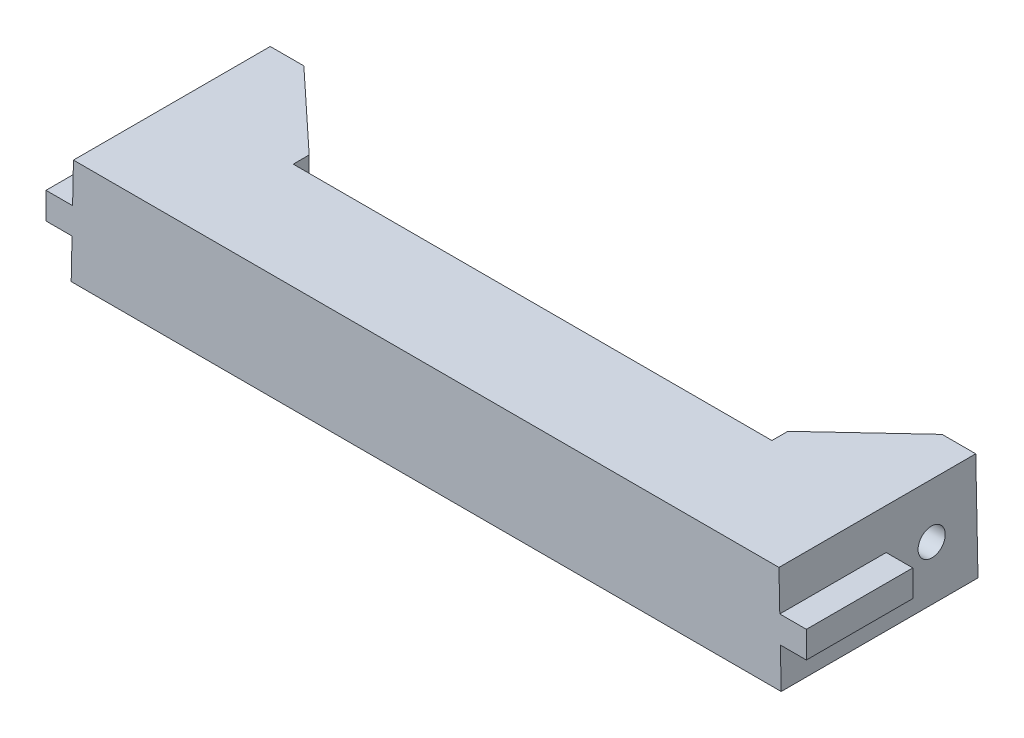
ISO-10303-21;
HEADER;
FILE_DESCRIPTION(('STEP AP214'),'2;1');
FILE_NAME('part.step','',(''),(''),'','','');
FILE_SCHEMA(('AUTOMOTIVE_DESIGN { 1 0 10303 214 1 1 1 1 }'));
ENDSEC;
DATA;
#1=APPLICATION_CONTEXT('core data for automotive mechanical design processes');
#2=APPLICATION_PROTOCOL_DEFINITION('international standard','automotive_design',2000,#1);
#3=PRODUCT_CONTEXT('',#1,'mechanical');
#4=PRODUCT('Part','Part','',(#3));
#5=PRODUCT_RELATED_PRODUCT_CATEGORY('part','',(#4));
#6=PRODUCT_DEFINITION_FORMATION('','',#4);
#7=PRODUCT_DEFINITION_CONTEXT('part definition',#1,'design');
#8=PRODUCT_DEFINITION('design','',#6,#7);
#9=PRODUCT_DEFINITION_SHAPE('','',#8);
#10=(LENGTH_UNIT() NAMED_UNIT(*) SI_UNIT(.MILLI.,.METRE.));
#11=(NAMED_UNIT(*) PLANE_ANGLE_UNIT() SI_UNIT($,.RADIAN.));
#12=(NAMED_UNIT(*) SI_UNIT($,.STERADIAN.) SOLID_ANGLE_UNIT());
#13=UNCERTAINTY_MEASURE_WITH_UNIT(LENGTH_MEASURE(1.E-05),#10,'distance_accuracy_value','');
#14=(GEOMETRIC_REPRESENTATION_CONTEXT(3) GLOBAL_UNCERTAINTY_ASSIGNED_CONTEXT((#13)) GLOBAL_UNIT_ASSIGNED_CONTEXT((#10,
#11,#12)) REPRESENTATION_CONTEXT('',''));
#15=CARTESIAN_POINT('',(0.,0.,0.));
#16=DIRECTION('',(0.,0.,1.));
#17=DIRECTION('',(1.,0.,0.));
#18=AXIS2_PLACEMENT_3D('',#15,#16,#17);
#19=CARTESIAN_POINT('',(0.,0.,0.));
#20=DIRECTION('',(0.,0.,1.));
#21=DIRECTION('',(1.,0.,0.));
#22=AXIS2_PLACEMENT_3D('',#19,#20,#21);
#23=PLANE('',#22);
#24=DIRECTION('',(0.,-1.,0.));
#25=VECTOR('',#24,1.);
#26=CARTESIAN_POINT('',(-45.,0.,0.));
#27=LINE('',#26,#25);
#28=CARTESIAN_POINT('',(-45.,20.,0.));
#29=VERTEX_POINT('',#28);
#30=CARTESIAN_POINT('',(-45.,0.,0.));
#31=VERTEX_POINT('',#30);
#32=EDGE_CURVE('E151',#29,#31,#27,.T.);
#33=ORIENTED_EDGE('',*,*,#32,.F.);
#34=DIRECTION('',(-1.,0.,0.));
#35=VECTOR('',#34,1.);
#36=CARTESIAN_POINT('',(-66.3208214077717,20.,0.));
#37=LINE('',#36,#35);
#38=CARTESIAN_POINT('',(45.,20.,0.));
#39=VERTEX_POINT('',#38);
#40=EDGE_CURVE('E764',#39,#29,#37,.T.);
#41=ORIENTED_EDGE('',*,*,#40,.F.);
#42=DIRECTION('',(0.,-1.,0.));
#43=VECTOR('',#42,1.);
#44=CARTESIAN_POINT('',(45.,20.,0.));
#45=LINE('',#44,#43);
#46=CARTESIAN_POINT('',(45.,0.,0.));
#47=VERTEX_POINT('',#46);
#48=EDGE_CURVE('E793',#39,#47,#45,.T.);
#49=ORIENTED_EDGE('',*,*,#48,.T.);
#50=DIRECTION('',(1.,0.,0.));
#51=VECTOR('',#50,1.);
#52=CARTESIAN_POINT('',(-66.745,0.,0.));
#53=LINE('',#52,#51);
#54=EDGE_CURVE('E792',#31,#47,#53,.T.);
#55=ORIENTED_EDGE('',*,*,#54,.F.);
#56=EDGE_LOOP('',(#33,#41,#49,#55));
#57=FACE_BOUND('',#56,.T.);
#58=ADVANCED_FACE('F126',(#57),#23,.F.);
#59=CARTESIAN_POINT('',(-66.745,0.,20.));
#60=DIRECTION('',(0.99977516650026,-0.021204161133545,0.));
#61=DIRECTION('',(0.021204161133545,0.99977516650026,0.));
#62=AXIS2_PLACEMENT_3D('',#59,#60,#61);
#63=PLANE('',#62);
#64=CARTESIAN_POINT('',(-66.5329107038858,10.,-8.5));
#65=DIRECTION('',(0.99977516650026,-0.021204161133545,0.));
#66=DIRECTION('',(0.021204161133545,0.99977516650026,0.));
#67=AXIS2_PLACEMENT_3D('',#64,#65,#66);
#68=ELLIPSE('',#67,2.55057345435609,2.55);
#69=CARTESIAN_POINT('',(-66.4788279333767,12.55,-8.5));
#70=VERTEX_POINT('',#69);
#71=EDGE_CURVE('E361',#70,#70,#68,.F.);
#72=ORIENTED_EDGE('',*,*,#71,.F.);
#73=EDGE_LOOP('',(#72));
#74=FACE_BOUND('',#73,.T.);
#75=DIRECTION('',(0.,0.,1.));
#76=VECTOR('',#75,1.);
#77=CARTESIAN_POINT('',(-66.4798883798573,12.5,-7.07106781186548));
#78=LINE('',#77,#76);
#79=CARTESIAN_POINT('',(-66.4798883798573,12.5,0.));
#80=VERTEX_POINT('',#79);
#81=CARTESIAN_POINT('',(-66.4798883798573,12.4999999999998,20.));
#82=VERTEX_POINT('',#81);
#83=EDGE_CURVE('E511',#80,#82,#78,.T.);
#84=ORIENTED_EDGE('',*,*,#83,.T.);
#85=DIRECTION('',(-0.021204161133545,-0.99977516650026,0.));
#86=VECTOR('',#85,1.);
#87=CARTESIAN_POINT('',(-66.745,0.,20.));
#88=LINE('',#87,#86);
#89=CARTESIAN_POINT('',(-66.3208214077717,20.,20.));
#90=VERTEX_POINT('',#89);
#91=EDGE_CURVE('E732',#90,#82,#88,.T.);
#92=ORIENTED_EDGE('',*,*,#91,.F.);
#93=DIRECTION('',(0.,0.,-1.));
#94=VECTOR('',#93,1.);
#95=CARTESIAN_POINT('',(-66.3208214077717,20.,20.));
#96=LINE('',#95,#94);
#97=CARTESIAN_POINT('',(-66.3208214077717,20.,0.));
#98=VERTEX_POINT('',#97);
#99=EDGE_CURVE('E701',#90,#98,#96,.T.);
#100=ORIENTED_EDGE('',*,*,#99,.T.);
#101=CARTESIAN_POINT('',(-66.3208214077717,20.,0.));
#102=DIRECTION('',(0.,0.,-1.));
#103=VECTOR('',#102,1.);
#104=LINE('',#101,#103);
#105=CARTESIAN_POINT('',(-66.3208214077717,20.,-17.));
#106=VERTEX_POINT('',#105);
#107=EDGE_CURVE('E412',#98,#106,#104,.T.);
#108=ORIENTED_EDGE('',*,*,#107,.T.);
#109=CARTESIAN_POINT('',(-66.3208214077717,20.,-17.));
#110=DIRECTION('',(-0.021204161133545,-0.99977516650026,0.));
#111=VECTOR('',#110,1.);
#112=LINE('',#109,#111);
#113=CARTESIAN_POINT('',(-66.745,0.,-17.));
#114=VERTEX_POINT('',#113);
#115=EDGE_CURVE('E718',#106,#114,#112,.T.);
#116=ORIENTED_EDGE('',*,*,#115,.T.);
#117=CARTESIAN_POINT('',(-66.745,0.,0.));
#118=DIRECTION('',(0.,0.,-1.));
#119=VECTOR('',#118,1.);
#120=LINE('',#117,#119);
#121=CARTESIAN_POINT('',(-66.745,0.,0.));
#122=VERTEX_POINT('',#121);
#123=EDGE_CURVE('E711',#122,#114,#120,.T.);
#124=ORIENTED_EDGE('',*,*,#123,.F.);
#125=DIRECTION('',(0.,0.,-1.));
#126=VECTOR('',#125,1.);
#127=CARTESIAN_POINT('',(-66.745,0.,20.));
#128=LINE('',#127,#126);
#129=CARTESIAN_POINT('',(-66.745,0.,20.));
#130=VERTEX_POINT('',#129);
#131=EDGE_CURVE('E697',#130,#122,#128,.T.);
#132=ORIENTED_EDGE('',*,*,#131,.F.);
#133=CARTESIAN_POINT('',(-66.5859330279144,7.5,20.));
#134=VERTEX_POINT('',#133);
#135=EDGE_CURVE('E739',#134,#130,#88,.T.);
#136=ORIENTED_EDGE('',*,*,#135,.F.);
#137=DIRECTION('',(0.,0.,1.));
#138=VECTOR('',#137,1.);
#139=CARTESIAN_POINT('',(-66.5859330279144,7.5,20.));
#140=LINE('',#139,#138);
#141=CARTESIAN_POINT('',(-66.5859330279144,7.5,0.));
#142=VERTEX_POINT('',#141);
#143=EDGE_CURVE('E531',#142,#134,#140,.T.);
#144=ORIENTED_EDGE('',*,*,#143,.F.);
#145=DIRECTION('',(-0.0212041611335429,-0.99977516650026,0.));
#146=VECTOR('',#145,1.);
#147=CARTESIAN_POINT('',(-66.4798883798573,12.5,0.));
#148=LINE('',#147,#146);
#149=EDGE_CURVE('E374',#80,#142,#148,.T.);
#150=ORIENTED_EDGE('',*,*,#149,.F.);
#151=EDGE_LOOP('',(#84,#92,#100,#108,#116,#124,#132,#136,#144,#150));
#152=FACE_BOUND('',#151,.T.);
#153=ADVANCED_FACE('F605',(#74,#152),#63,.F.);
#154=CARTESIAN_POINT('',(66.3208214077717,20.,20.));
#155=DIRECTION('',(-0.99977516650026,-0.021204161133545,0.));
#156=DIRECTION('',(0.021204161133545,-0.99977516650026,0.));
#157=AXIS2_PLACEMENT_3D('',#154,#155,#156);
#158=PLANE('',#157);
#159=CARTESIAN_POINT('',(66.5329107038858,10.,-8.5));
#160=DIRECTION('',(-0.99977516650026,-0.021204161133545,0.));
#161=DIRECTION('',(-0.021204161133545,0.99977516650026,0.));
#162=AXIS2_PLACEMENT_3D('',#159,#160,#161);
#163=ELLIPSE('',#162,2.55057345435609,2.55);
#164=CARTESIAN_POINT('',(66.4788279333767,12.55,-8.5));
#165=VERTEX_POINT('',#164);
#166=EDGE_CURVE('E490',#165,#165,#163,.T.);
#167=ORIENTED_EDGE('',*,*,#166,.T.);
#168=EDGE_LOOP('',(#167));
#169=FACE_BOUND('',#168,.T.);
#170=DIRECTION('',(-0.021204161133545,0.99977516650026,0.));
#171=VECTOR('',#170,1.);
#172=CARTESIAN_POINT('',(66.3208214077717,20.,20.));
#173=LINE('',#172,#171);
#174=CARTESIAN_POINT('',(66.4798883798573,12.5,20.));
#175=VERTEX_POINT('',#174);
#176=CARTESIAN_POINT('',(66.3208214077717,20.,20.));
#177=VERTEX_POINT('',#176);
#178=EDGE_CURVE('E741',#175,#177,#173,.T.);
#179=ORIENTED_EDGE('',*,*,#178,.F.);
#180=DIRECTION('',(0.,0.,1.));
#181=VECTOR('',#180,1.);
#182=CARTESIAN_POINT('',(66.4798883798573,12.5,-7.07106781186548));
#183=LINE('',#182,#181);
#184=CARTESIAN_POINT('',(66.4798883798573,12.5,0.));
#185=VERTEX_POINT('',#184);
#186=EDGE_CURVE('E523',#185,#175,#183,.T.);
#187=ORIENTED_EDGE('',*,*,#186,.F.);
#188=DIRECTION('',(-0.021204161133545,0.99977516650026,0.));
#189=VECTOR('',#188,1.);
#190=CARTESIAN_POINT('',(66.3208214077717,20.,0.));
#191=LINE('',#190,#189);
#192=CARTESIAN_POINT('',(66.5859330279144,7.5,0.));
#193=VERTEX_POINT('',#192);
#194=EDGE_CURVE('E675',#193,#185,#191,.T.);
#195=ORIENTED_EDGE('',*,*,#194,.F.);
#196=DIRECTION('',(0.,0.,1.));
#197=VECTOR('',#196,1.);
#198=CARTESIAN_POINT('',(66.5859330279144,7.5,20.));
#199=LINE('',#198,#197);
#200=CARTESIAN_POINT('',(66.5859330279144,7.5,20.));
#201=VERTEX_POINT('',#200);
#202=EDGE_CURVE('E552',#193,#201,#199,.T.);
#203=ORIENTED_EDGE('',*,*,#202,.T.);
#204=CARTESIAN_POINT('',(66.745,0.,20.));
#205=VERTEX_POINT('',#204);
#206=EDGE_CURVE('E577',#205,#201,#173,.T.);
#207=ORIENTED_EDGE('',*,*,#206,.F.);
#208=DIRECTION('',(0.,0.,-1.));
#209=VECTOR('',#208,1.);
#210=CARTESIAN_POINT('',(66.745,0.,20.));
#211=LINE('',#210,#209);
#212=CARTESIAN_POINT('',(66.745,0.,0.));
#213=VERTEX_POINT('',#212);
#214=EDGE_CURVE('E702',#205,#213,#211,.T.);
#215=ORIENTED_EDGE('',*,*,#214,.T.);
#216=DIRECTION('',(0.,0.,-1.));
#217=VECTOR('',#216,1.);
#218=CARTESIAN_POINT('',(66.745,0.,0.));
#219=LINE('',#218,#217);
#220=CARTESIAN_POINT('',(66.745,0.,-17.));
#221=VERTEX_POINT('',#220);
#222=EDGE_CURVE('E565',#213,#221,#219,.T.);
#223=ORIENTED_EDGE('',*,*,#222,.T.);
#224=DIRECTION('',(0.021204161133545,-0.99977516650026,0.));
#225=VECTOR('',#224,1.);
#226=CARTESIAN_POINT('',(66.3208214077717,20.,-17.));
#227=LINE('',#226,#225);
#228=CARTESIAN_POINT('',(66.3208214077717,20.,-17.));
#229=VERTEX_POINT('',#228);
#230=EDGE_CURVE('E572',#229,#221,#227,.T.);
#231=ORIENTED_EDGE('',*,*,#230,.F.);
#232=DIRECTION('',(0.,0.,-1.));
#233=VECTOR('',#232,1.);
#234=CARTESIAN_POINT('',(66.3208214077717,20.,0.));
#235=LINE('',#234,#233);
#236=CARTESIAN_POINT('',(66.3208214077717,20.,0.));
#237=VERTEX_POINT('',#236);
#238=EDGE_CURVE('E742',#237,#229,#235,.T.);
#239=ORIENTED_EDGE('',*,*,#238,.F.);
#240=DIRECTION('',(0.,0.,-1.));
#241=VECTOR('',#240,1.);
#242=CARTESIAN_POINT('',(66.3208214077717,20.,20.));
#243=LINE('',#242,#241);
#244=EDGE_CURVE('E707',#177,#237,#243,.T.);
#245=ORIENTED_EDGE('',*,*,#244,.F.);
#246=EDGE_LOOP('',(#179,#187,#195,#203,#207,#215,#223,#231,#239,#245));
#247=FACE_BOUND('',#246,.T.);
#248=ADVANCED_FACE('F128',(#169,#247),#158,.F.);
#249=CARTESIAN_POINT('',(-66.3208214077717,20.,20.));
#250=DIRECTION('',(0.,-1.,0.));
#251=DIRECTION('',(0.,0.,-1.));
#252=AXIS2_PLACEMENT_3D('',#249,#250,#251);
#253=PLANE('',#252);
#254=ORIENTED_EDGE('',*,*,#40,.T.);
#255=CARTESIAN_POINT('',(-45.,20.,-3.));
#256=DIRECTION('',(0.,0.,1.));
#257=VECTOR('',#256,1.);
#258=LINE('',#255,#257);
#259=CARTESIAN_POINT('',(-45.,20.,-3.));
#260=VERTEX_POINT('',#259);
#261=EDGE_CURVE('E338',#260,#29,#258,.T.);
#262=ORIENTED_EDGE('',*,*,#261,.F.);
#263=DIRECTION('',(0.731055268242869,0.,0.682318250360011));
#264=VECTOR('',#263,1.);
#265=CARTESIAN_POINT('',(-60.,20.,-17.));
#266=LINE('',#265,#264);
#267=CARTESIAN_POINT('',(-60.,20.,-17.));
#268=VERTEX_POINT('',#267);
#269=EDGE_CURVE('E298',#268,#260,#266,.T.);
#270=ORIENTED_EDGE('',*,*,#269,.F.);
#271=DIRECTION('',(-1.,0.,0.));
#272=VECTOR('',#271,1.);
#273=CARTESIAN_POINT('',(-60.,20.,-17.));
#274=LINE('',#273,#272);
#275=EDGE_CURVE('E366',#268,#106,#274,.T.);
#276=ORIENTED_EDGE('',*,*,#275,.T.);
#277=ORIENTED_EDGE('',*,*,#107,.F.);
#278=ORIENTED_EDGE('',*,*,#99,.F.);
#279=DIRECTION('',(-1.,0.,0.));
#280=VECTOR('',#279,1.);
#281=CARTESIAN_POINT('',(-66.3208214077717,20.,20.));
#282=LINE('',#281,#280);
#283=EDGE_CURVE('E735',#177,#90,#282,.T.);
#284=ORIENTED_EDGE('',*,*,#283,.F.);
#285=ORIENTED_EDGE('',*,*,#244,.T.);
#286=ORIENTED_EDGE('',*,*,#238,.T.);
#287=DIRECTION('',(1.,0.,0.));
#288=VECTOR('',#287,1.);
#289=CARTESIAN_POINT('',(60.,20.,-17.));
#290=LINE('',#289,#288);
#291=CARTESIAN_POINT('',(60.,20.,-17.));
#292=VERTEX_POINT('',#291);
#293=EDGE_CURVE('E556',#292,#229,#290,.T.);
#294=ORIENTED_EDGE('',*,*,#293,.F.);
#295=DIRECTION('',(-0.731055268242869,0.,0.682318250360011));
#296=VECTOR('',#295,1.);
#297=CARTESIAN_POINT('',(60.,20.,-17.));
#298=LINE('',#297,#296);
#299=CARTESIAN_POINT('',(45.,20.,-3.));
#300=VERTEX_POINT('',#299);
#301=EDGE_CURVE('E419',#292,#300,#298,.T.);
#302=ORIENTED_EDGE('',*,*,#301,.T.);
#303=DIRECTION('',(0.,0.,1.));
#304=VECTOR('',#303,1.);
#305=CARTESIAN_POINT('',(45.,20.,-3.));
#306=LINE('',#305,#304);
#307=EDGE_CURVE('E423',#300,#39,#306,.T.);
#308=ORIENTED_EDGE('',*,*,#307,.T.);
#309=EDGE_LOOP('',(#254,#262,#270,#276,#277,#278,#284,#285,#286,#294,#302,#308));
#310=FACE_BOUND('',#309,.T.);
#311=ADVANCED_FACE('F604',(#310),#253,.F.);
#312=CARTESIAN_POINT('',(-66.745,0.,20.));
#313=DIRECTION('',(0.,1.,0.));
#314=DIRECTION('',(0.,0.,1.));
#315=AXIS2_PLACEMENT_3D('',#312,#313,#314);
#316=PLANE('',#315);
#317=CARTESIAN_POINT('',(-45.,0.,0.));
#318=DIRECTION('',(0.,0.,-1.));
#319=VECTOR('',#318,1.);
#320=LINE('',#317,#319);
#321=CARTESIAN_POINT('',(-45.,0.,-3.));
#322=VERTEX_POINT('',#321);
#323=EDGE_CURVE('E301',#31,#322,#320,.T.);
#324=ORIENTED_EDGE('',*,*,#323,.F.);
#325=ORIENTED_EDGE('',*,*,#54,.T.);
#326=DIRECTION('',(0.,0.,-1.));
#327=VECTOR('',#326,1.);
#328=CARTESIAN_POINT('',(45.,0.,0.));
#329=LINE('',#328,#327);
#330=CARTESIAN_POINT('',(45.,0.,-3.));
#331=VERTEX_POINT('',#330);
#332=EDGE_CURVE('E1177',#47,#331,#329,.T.);
#333=ORIENTED_EDGE('',*,*,#332,.T.);
#334=DIRECTION('',(-0.731055268242869,0.,0.682318250360011));
#335=VECTOR('',#334,1.);
#336=CARTESIAN_POINT('',(60.,0.,-17.));
#337=LINE('',#336,#335);
#338=CARTESIAN_POINT('',(60.,0.,-17.));
#339=VERTEX_POINT('',#338);
#340=EDGE_CURVE('E424',#339,#331,#337,.T.);
#341=ORIENTED_EDGE('',*,*,#340,.F.);
#342=DIRECTION('',(1.,0.,0.));
#343=VECTOR('',#342,1.);
#344=CARTESIAN_POINT('',(60.,0.,-17.));
#345=LINE('',#344,#343);
#346=EDGE_CURVE('E559',#339,#221,#345,.T.);
#347=ORIENTED_EDGE('',*,*,#346,.T.);
#348=ORIENTED_EDGE('',*,*,#222,.F.);
#349=ORIENTED_EDGE('',*,*,#214,.F.);
#350=DIRECTION('',(1.,0.,0.));
#351=VECTOR('',#350,1.);
#352=CARTESIAN_POINT('',(-66.745,0.,20.));
#353=LINE('',#352,#351);
#354=EDGE_CURVE('E760',#130,#205,#353,.T.);
#355=ORIENTED_EDGE('',*,*,#354,.F.);
#356=ORIENTED_EDGE('',*,*,#131,.T.);
#357=ORIENTED_EDGE('',*,*,#123,.T.);
#358=DIRECTION('',(-1.,0.,0.));
#359=VECTOR('',#358,1.);
#360=CARTESIAN_POINT('',(-60.,0.,-17.));
#361=LINE('',#360,#359);
#362=CARTESIAN_POINT('',(-60.,0.,-17.));
#363=VERTEX_POINT('',#362);
#364=EDGE_CURVE('E369',#363,#114,#361,.T.);
#365=ORIENTED_EDGE('',*,*,#364,.F.);
#366=DIRECTION('',(0.731055268242869,0.,0.682318250360011));
#367=VECTOR('',#366,1.);
#368=CARTESIAN_POINT('',(-60.,0.,-17.));
#369=LINE('',#368,#367);
#370=EDGE_CURVE('E339',#363,#322,#369,.T.);
#371=ORIENTED_EDGE('',*,*,#370,.T.);
#372=EDGE_LOOP('',(#324,#325,#333,#341,#347,#348,#349,#355,#356,#357,#365,#371));
#373=FACE_BOUND('',#372,.T.);
#374=ADVANCED_FACE('F596',(#373),#316,.F.);
#375=CARTESIAN_POINT('',(0.,0.,20.));
#376=DIRECTION('',(0.,0.,1.));
#377=DIRECTION('',(1.,0.,0.));
#378=AXIS2_PLACEMENT_3D('',#375,#376,#377);
#379=PLANE('',#378);
#380=ORIENTED_EDGE('',*,*,#91,.T.);
#381=DIRECTION('',(1.,0.,0.));
#382=VECTOR('',#381,1.);
#383=CARTESIAN_POINT('',(-66.4798883798573,12.5,20.));
#384=LINE('',#383,#382);
#385=CARTESIAN_POINT('',(-71.4798883798573,12.5,20.));
#386=VERTEX_POINT('',#385);
#387=EDGE_CURVE('E494',#386,#82,#384,.T.);
#388=ORIENTED_EDGE('',*,*,#387,.F.);
#389=DIRECTION('',(0.,1.,0.));
#390=VECTOR('',#389,1.);
#391=CARTESIAN_POINT('',(-71.4798883798573,12.5,20.));
#392=LINE('',#391,#390);
#393=CARTESIAN_POINT('',(-71.4798883798573,7.5,20.));
#394=VERTEX_POINT('',#393);
#395=EDGE_CURVE('E504',#394,#386,#392,.T.);
#396=ORIENTED_EDGE('',*,*,#395,.F.);
#397=DIRECTION('',(-1.,0.,0.));
#398=VECTOR('',#397,1.);
#399=CARTESIAN_POINT('',(-66.4798883798573,7.5,20.));
#400=LINE('',#399,#398);
#401=EDGE_CURVE('E508',#134,#394,#400,.T.);
#402=ORIENTED_EDGE('',*,*,#401,.F.);
#403=ORIENTED_EDGE('',*,*,#135,.T.);
#404=ORIENTED_EDGE('',*,*,#354,.T.);
#405=ORIENTED_EDGE('',*,*,#206,.T.);
#406=DIRECTION('',(1.,0.,0.));
#407=VECTOR('',#406,1.);
#408=CARTESIAN_POINT('',(66.4798883798573,7.5,20.));
#409=LINE('',#408,#407);
#410=CARTESIAN_POINT('',(71.4798883798573,7.5,20.));
#411=VERTEX_POINT('',#410);
#412=EDGE_CURVE('E527',#201,#411,#409,.T.);
#413=ORIENTED_EDGE('',*,*,#412,.T.);
#414=DIRECTION('',(0.,1.,0.));
#415=VECTOR('',#414,1.);
#416=CARTESIAN_POINT('',(71.4798883798573,12.5,20.));
#417=LINE('',#416,#415);
#418=CARTESIAN_POINT('',(71.4798883798573,12.5,20.));
#419=VERTEX_POINT('',#418);
#420=EDGE_CURVE('E530',#411,#419,#417,.T.);
#421=ORIENTED_EDGE('',*,*,#420,.T.);
#422=DIRECTION('',(-1.,0.,0.));
#423=VECTOR('',#422,1.);
#424=CARTESIAN_POINT('',(66.4798883798573,12.5,20.));
#425=LINE('',#424,#423);
#426=EDGE_CURVE('E535',#419,#175,#425,.T.);
#427=ORIENTED_EDGE('',*,*,#426,.T.);
#428=ORIENTED_EDGE('',*,*,#178,.T.);
#429=ORIENTED_EDGE('',*,*,#283,.T.);
#430=EDGE_LOOP('',(#380,#388,#396,#402,#403,#404,#405,#413,#421,#427,#428,#429));
#431=FACE_BOUND('',#430,.T.);
#432=ADVANCED_FACE('F593',(#431),#379,.T.);
#433=DIRECTION('',(-1.,0.,0.));
#434=VECTOR('',#433,1.);
#435=CARTESIAN_POINT('',(-66.4798883798573,12.5,0.));
#436=LINE('',#435,#434);
#437=CARTESIAN_POINT('',(-71.4798883798573,12.5,0.));
#438=VERTEX_POINT('',#437);
#439=EDGE_CURVE('E500',#80,#438,#436,.T.);
#440=ORIENTED_EDGE('',*,*,#439,.F.);
#441=ORIENTED_EDGE('',*,*,#149,.T.);
#442=DIRECTION('',(1.,0.,0.));
#443=VECTOR('',#442,1.);
#444=CARTESIAN_POINT('',(-66.4798883798573,7.5,0.));
#445=LINE('',#444,#443);
#446=CARTESIAN_POINT('',(-71.4798883798573,7.5,0.));
#447=VERTEX_POINT('',#446);
#448=EDGE_CURVE('E499',#447,#142,#445,.T.);
#449=ORIENTED_EDGE('',*,*,#448,.F.);
#450=DIRECTION('',(0.,-1.,0.));
#451=VECTOR('',#450,1.);
#452=CARTESIAN_POINT('',(-71.4798883798573,12.5,0.));
#453=LINE('',#452,#451);
#454=EDGE_CURVE('E495',#438,#447,#453,.T.);
#455=ORIENTED_EDGE('',*,*,#454,.F.);
#456=EDGE_LOOP('',(#440,#441,#449,#455));
#457=FACE_BOUND('',#456,.T.);
#458=ADVANCED_FACE('F590',(#457),#23,.F.);
#459=CARTESIAN_POINT('',(0.,0.,-17.));
#460=DIRECTION('',(0.,0.,1.));
#461=DIRECTION('',(0.,-1.,0.));
#462=AXIS2_PLACEMENT_3D('',#459,#460,#461);
#463=PLANE('',#462);
#464=ORIENTED_EDGE('',*,*,#293,.T.);
#465=ORIENTED_EDGE('',*,*,#230,.T.);
#466=ORIENTED_EDGE('',*,*,#346,.F.);
#467=DIRECTION('',(0.,1.,0.));
#468=VECTOR('',#467,1.);
#469=CARTESIAN_POINT('',(60.,20.,-17.));
#470=LINE('',#469,#468);
#471=EDGE_CURVE('E555',#339,#292,#470,.T.);
#472=ORIENTED_EDGE('',*,*,#471,.T.);
#473=EDGE_LOOP('',(#464,#465,#466,#472));
#474=FACE_BOUND('',#473,.T.);
#475=ADVANCED_FACE('F579',(#474),#463,.F.);
#476=CARTESIAN_POINT('',(0.,0.,0.));
#477=DIRECTION('',(0.,0.,1.));
#478=DIRECTION('',(1.,0.,0.));
#479=AXIS2_PLACEMENT_3D('',#476,#477,#478);
#480=PLANE('',#479);
#481=DIRECTION('',(-1.,0.,0.));
#482=VECTOR('',#481,1.);
#483=CARTESIAN_POINT('',(66.4798883798573,7.5,0.));
#484=LINE('',#483,#482);
#485=CARTESIAN_POINT('',(71.4798883798573,7.5,0.));
#486=VERTEX_POINT('',#485);
#487=EDGE_CURVE('E526',#486,#193,#484,.T.);
#488=ORIENTED_EDGE('',*,*,#487,.T.);
#489=ORIENTED_EDGE('',*,*,#194,.T.);
#490=DIRECTION('',(1.,0.,0.));
#491=VECTOR('',#490,1.);
#492=CARTESIAN_POINT('',(66.4798883798573,12.5,0.));
#493=LINE('',#492,#491);
#494=CARTESIAN_POINT('',(71.4798883798573,12.5,0.));
#495=VERTEX_POINT('',#494);
#496=EDGE_CURVE('E522',#185,#495,#493,.T.);
#497=ORIENTED_EDGE('',*,*,#496,.T.);
#498=DIRECTION('',(0.,-1.,0.));
#499=VECTOR('',#498,1.);
#500=CARTESIAN_POINT('',(71.4798883798573,12.5,0.));
#501=LINE('',#500,#499);
#502=EDGE_CURVE('E519',#495,#486,#501,.T.);
#503=ORIENTED_EDGE('',*,*,#502,.T.);
#504=EDGE_LOOP('',(#488,#489,#497,#503));
#505=FACE_BOUND('',#504,.T.);
#506=ADVANCED_FACE('F589',(#505),#480,.F.);
#507=CARTESIAN_POINT('',(66.4798883798573,7.5,-7.07106781186548));
#508=DIRECTION('',(0.,-1.,0.));
#509=DIRECTION('',(0.,0.,-1.));
#510=AXIS2_PLACEMENT_3D('',#507,#508,#509);
#511=PLANE('',#510);
#512=ORIENTED_EDGE('',*,*,#202,.F.);
#513=ORIENTED_EDGE('',*,*,#487,.F.);
#514=DIRECTION('',(0.,0.,1.));
#515=VECTOR('',#514,1.);
#516=CARTESIAN_POINT('',(71.4798883798573,7.5,-7.07106781186548));
#517=LINE('',#516,#515);
#518=EDGE_CURVE('E539',#486,#411,#517,.T.);
#519=ORIENTED_EDGE('',*,*,#518,.T.);
#520=ORIENTED_EDGE('',*,*,#412,.F.);
#521=EDGE_LOOP('',(#512,#513,#519,#520));
#522=FACE_BOUND('',#521,.T.);
#523=ADVANCED_FACE('F591',(#522),#511,.T.);
#524=CARTESIAN_POINT('',(66.4798883798573,12.5,-7.07106781186548));
#525=DIRECTION('',(0.,1.,0.));
#526=DIRECTION('',(0.,0.,1.));
#527=AXIS2_PLACEMENT_3D('',#524,#525,#526);
#528=PLANE('',#527);
#529=ORIENTED_EDGE('',*,*,#496,.F.);
#530=ORIENTED_EDGE('',*,*,#186,.T.);
#531=ORIENTED_EDGE('',*,*,#426,.F.);
#532=DIRECTION('',(0.,0.,1.));
#533=VECTOR('',#532,1.);
#534=CARTESIAN_POINT('',(71.4798883798573,12.5,-7.07106781186548));
#535=LINE('',#534,#533);
#536=EDGE_CURVE('E543',#495,#419,#535,.T.);
#537=ORIENTED_EDGE('',*,*,#536,.F.);
#538=EDGE_LOOP('',(#529,#530,#531,#537));
#539=FACE_BOUND('',#538,.T.);
#540=ADVANCED_FACE('F1023',(#539),#528,.T.);
#541=CARTESIAN_POINT('',(71.4798883798573,12.5,-7.07106781186548));
#542=DIRECTION('',(1.,0.,0.));
#543=DIRECTION('',(0.,0.,-1.));
#544=AXIS2_PLACEMENT_3D('',#541,#542,#543);
#545=PLANE('',#544);
#546=ORIENTED_EDGE('',*,*,#502,.F.);
#547=ORIENTED_EDGE('',*,*,#536,.T.);
#548=ORIENTED_EDGE('',*,*,#420,.F.);
#549=ORIENTED_EDGE('',*,*,#518,.F.);
#550=EDGE_LOOP('',(#546,#547,#548,#549));
#551=FACE_BOUND('',#550,.T.);
#552=ADVANCED_FACE('F1004',(#551),#545,.T.);
#553=CARTESIAN_POINT('',(-66.4798883798573,7.5,-7.07106781186548));
#554=DIRECTION('',(0.,1.,0.));
#555=DIRECTION('',(0.,0.,1.));
#556=AXIS2_PLACEMENT_3D('',#553,#554,#555);
#557=PLANE('',#556);
#558=ORIENTED_EDGE('',*,*,#448,.T.);
#559=ORIENTED_EDGE('',*,*,#143,.T.);
#560=ORIENTED_EDGE('',*,*,#401,.T.);
#561=DIRECTION('',(0.,0.,1.));
#562=VECTOR('',#561,1.);
#563=CARTESIAN_POINT('',(-71.4798883798573,7.5,-7.07106781186548));
#564=LINE('',#563,#562);
#565=EDGE_CURVE('E512',#447,#394,#564,.T.);
#566=ORIENTED_EDGE('',*,*,#565,.F.);
#567=EDGE_LOOP('',(#558,#559,#560,#566));
#568=FACE_BOUND('',#567,.T.);
#569=ADVANCED_FACE('F994',(#568),#557,.F.);
#570=CARTESIAN_POINT('',(-66.4798883798573,12.5,-7.07106781186548));
#571=DIRECTION('',(0.,-1.,0.));
#572=DIRECTION('',(0.,0.,-1.));
#573=AXIS2_PLACEMENT_3D('',#570,#571,#572);
#574=PLANE('',#573);
#575=ORIENTED_EDGE('',*,*,#83,.F.);
#576=ORIENTED_EDGE('',*,*,#439,.T.);
#577=DIRECTION('',(0.,0.,1.));
#578=VECTOR('',#577,1.);
#579=CARTESIAN_POINT('',(-71.4798883798573,12.5,-7.07106781186548));
#580=LINE('',#579,#578);
#581=EDGE_CURVE('E516',#438,#386,#580,.T.);
#582=ORIENTED_EDGE('',*,*,#581,.T.);
#583=ORIENTED_EDGE('',*,*,#387,.T.);
#584=EDGE_LOOP('',(#575,#576,#582,#583));
#585=FACE_BOUND('',#584,.T.);
#586=ADVANCED_FACE('F984',(#585),#574,.F.);
#587=CARTESIAN_POINT('',(-71.4798883798573,12.5,-7.07106781186548));
#588=DIRECTION('',(1.,0.,0.));
#589=DIRECTION('',(0.,0.,-1.));
#590=AXIS2_PLACEMENT_3D('',#587,#588,#589);
#591=PLANE('',#590);
#592=ORIENTED_EDGE('',*,*,#581,.F.);
#593=ORIENTED_EDGE('',*,*,#454,.T.);
#594=ORIENTED_EDGE('',*,*,#565,.T.);
#595=ORIENTED_EDGE('',*,*,#395,.T.);
#596=EDGE_LOOP('',(#592,#593,#594,#595));
#597=FACE_BOUND('',#596,.T.);
#598=ADVANCED_FACE('F974',(#597),#591,.F.);
#599=CARTESIAN_POINT('',(71.4798883798573,10.,-8.5));
#600=DIRECTION('',(-1.,0.,0.));
#601=DIRECTION('',(0.,0.,1.));
#602=AXIS2_PLACEMENT_3D('',#599,#600,#601);
#603=CYLINDRICAL_SURFACE('',#602,2.55);
#604=CARTESIAN_POINT('',(60.,10.,-8.5));
#605=DIRECTION('',(-1.,0.,0.));
#606=DIRECTION('',(0.,0.,1.));
#607=AXIS2_PLACEMENT_3D('',#604,#605,#606);
#608=CIRCLE('',#607,2.55);
#609=CARTESIAN_POINT('',(60.,10.,-5.95));
#610=VERTEX_POINT('',#609);
#611=EDGE_CURVE('E416',#610,#610,#608,.F.);
#612=ORIENTED_EDGE('',*,*,#611,.F.);
#613=EDGE_LOOP('',(#612));
#614=FACE_BOUND('',#613,.T.);
#615=ORIENTED_EDGE('',*,*,#166,.F.);
#616=EDGE_LOOP('',(#615));
#617=FACE_BOUND('',#616,.T.);
#618=ADVANCED_FACE('F457',(#614,#617),#603,.F.);
#619=CARTESIAN_POINT('',(45.,0.,0.));
#620=DIRECTION('',(1.,0.,0.));
#621=DIRECTION('',(0.,0.,-1.));
#622=AXIS2_PLACEMENT_3D('',#619,#620,#621);
#623=PLANE('',#622);
#624=DIRECTION('',(0.,1.,0.));
#625=VECTOR('',#624,1.);
#626=CARTESIAN_POINT('',(45.,0.,-3.));
#627=LINE('',#626,#625);
#628=CARTESIAN_POINT('',(45.,13.4641016151369,-3.));
#629=VERTEX_POINT('',#628);
#630=EDGE_CURVE('E671',#629,#300,#627,.T.);
#631=ORIENTED_EDGE('',*,*,#630,.F.);
#632=CARTESIAN_POINT('',(45.,10.,-8.5));
#633=DIRECTION('',(1.,0.,0.));
#634=DIRECTION('',(0.,0.,-1.));
#635=AXIS2_PLACEMENT_3D('',#632,#633,#634);
#636=CIRCLE('',#635,6.5);
#637=CARTESIAN_POINT('',(45.,6.53589838486225,-3.));
#638=VERTEX_POINT('',#637);
#639=EDGE_CURVE('E411',#629,#638,#636,.T.);
#640=ORIENTED_EDGE('',*,*,#639,.T.);
#641=DIRECTION('',(0.,1.,0.));
#642=VECTOR('',#641,1.);
#643=CARTESIAN_POINT('',(45.,0.,-3.));
#644=LINE('',#643,#642);
#645=EDGE_CURVE('E436',#331,#638,#644,.T.);
#646=ORIENTED_EDGE('',*,*,#645,.F.);
#647=ORIENTED_EDGE('',*,*,#332,.F.);
#648=ORIENTED_EDGE('',*,*,#48,.F.);
#649=ORIENTED_EDGE('',*,*,#307,.F.);
#650=EDGE_LOOP('',(#631,#640,#646,#647,#648,#649));
#651=FACE_BOUND('',#650,.T.);
#652=ADVANCED_FACE('F453',(#651),#623,.F.);
#653=CARTESIAN_POINT('',(19.4536817102138,0.,20.8432304038005));
#654=DIRECTION('',(-0.682318250360011,0.,-0.731055268242869));
#655=DIRECTION('',(-0.731055268242869,0.,0.682318250360011));
#656=AXIS2_PLACEMENT_3D('',#653,#654,#655);
#657=PLANE('',#656);
#658=CARTESIAN_POINT('',(50.8928571428571,10.,-8.5));
#659=DIRECTION('',(-0.682318250360011,0.,-0.731055268242869));
#660=DIRECTION('',(0.731055268242869,0.,-0.682318250360011));
#661=AXIS2_PLACEMENT_3D('',#658,#659,#660);
#662=ELLIPSE('',#661,9.52634638831719,6.5);
#663=EDGE_CURVE('E137',#629,#638,#662,.T.);
#664=ORIENTED_EDGE('',*,*,#663,.F.);
#665=ORIENTED_EDGE('',*,*,#630,.T.);
#666=ORIENTED_EDGE('',*,*,#301,.F.);
#667=ORIENTED_EDGE('',*,*,#471,.F.);
#668=ORIENTED_EDGE('',*,*,#340,.T.);
#669=ORIENTED_EDGE('',*,*,#645,.T.);
#670=EDGE_LOOP('',(#664,#665,#666,#667,#668,#669));
#671=FACE_BOUND('',#670,.T.);
#672=ADVANCED_FACE('F443',(#671),#657,.T.);
#673=CARTESIAN_POINT('',(30.,10.,-8.5));
#674=DIRECTION('',(1.,0.,0.));
#675=DIRECTION('',(0.,0.,-1.));
#676=AXIS2_PLACEMENT_3D('',#673,#674,#675);
#677=CYLINDRICAL_SURFACE('',#676,6.5);
#678=CARTESIAN_POINT('',(60.,10.,-8.5));
#679=DIRECTION('',(1.,0.,0.));
#680=DIRECTION('',(0.,0.,-1.));
#681=AXIS2_PLACEMENT_3D('',#678,#679,#680);
#682=CIRCLE('',#681,6.5);
#683=CARTESIAN_POINT('',(60.,10.,-15.));
#684=VERTEX_POINT('',#683);
#685=EDGE_CURVE('E402',#684,#684,#682,.T.);
#686=ORIENTED_EDGE('',*,*,#685,.T.);
#687=EDGE_LOOP('',(#686));
#688=FACE_BOUND('',#687,.T.);
#689=ORIENTED_EDGE('',*,*,#663,.T.);
#690=ORIENTED_EDGE('',*,*,#639,.F.);
#691=EDGE_LOOP('',(#689,#690));
#692=FACE_BOUND('',#691,.T.);
#693=ADVANCED_FACE('F452',(#688,#692),#677,.F.);
#694=CARTESIAN_POINT('',(60.,10.,-8.5));
#695=DIRECTION('',(1.,0.,0.));
#696=DIRECTION('',(0.,0.,-1.));
#697=AXIS2_PLACEMENT_3D('',#694,#695,#696);
#698=PLANE('',#697);
#699=ORIENTED_EDGE('',*,*,#611,.T.);
#700=EDGE_LOOP('',(#699));
#701=FACE_BOUND('',#700,.T.);
#702=ORIENTED_EDGE('',*,*,#685,.F.);
#703=EDGE_LOOP('',(#702));
#704=FACE_BOUND('',#703,.T.);
#705=ADVANCED_FACE('F396',(#701,#704),#698,.F.);
#706=CARTESIAN_POINT('',(0.,0.,-17.));
#707=DIRECTION('',(0.,0.,1.));
#708=DIRECTION('',(0.,-1.,0.));
#709=AXIS2_PLACEMENT_3D('',#706,#707,#708);
#710=PLANE('',#709);
#711=ORIENTED_EDGE('',*,*,#275,.F.);
#712=CARTESIAN_POINT('',(-60.,0.,-17.));
#713=DIRECTION('',(0.,1.,0.));
#714=VECTOR('',#713,1.);
#715=LINE('',#712,#714);
#716=EDGE_CURVE('E365',#363,#268,#715,.T.);
#717=ORIENTED_EDGE('',*,*,#716,.F.);
#718=ORIENTED_EDGE('',*,*,#364,.T.);
#719=ORIENTED_EDGE('',*,*,#115,.F.);
#720=EDGE_LOOP('',(#711,#717,#718,#719));
#721=FACE_BOUND('',#720,.T.);
#722=ADVANCED_FACE('F386',(#721),#710,.F.);
#723=CARTESIAN_POINT('',(-71.4799133798573,10.,-8.5));
#724=DIRECTION('',(1.,0.,0.));
#725=DIRECTION('',(0.,0.,-1.));
#726=AXIS2_PLACEMENT_3D('',#723,#724,#725);
#727=CYLINDRICAL_SURFACE('',#726,2.55);
#728=CARTESIAN_POINT('',(-60.,10.,-8.5));
#729=DIRECTION('',(-1.,0.,0.));
#730=DIRECTION('',(0.,0.,1.));
#731=AXIS2_PLACEMENT_3D('',#728,#729,#730);
#732=CIRCLE('',#731,2.55);
#733=CARTESIAN_POINT('',(-60.,10.,-5.95));
#734=VERTEX_POINT('',#733);
#735=EDGE_CURVE('E291',#734,#734,#732,.T.);
#736=ORIENTED_EDGE('',*,*,#735,.F.);
#737=EDGE_LOOP('',(#736));
#738=FACE_BOUND('',#737,.T.);
#739=ORIENTED_EDGE('',*,*,#71,.T.);
#740=EDGE_LOOP('',(#739));
#741=FACE_BOUND('',#740,.T.);
#742=ADVANCED_FACE('F395',(#738,#741),#727,.F.);
#743=CARTESIAN_POINT('',(-45.,0.,0.));
#744=DIRECTION('',(-1.,0.,0.));
#745=DIRECTION('',(0.,0.,-1.));
#746=AXIS2_PLACEMENT_3D('',#743,#744,#745);
#747=PLANE('',#746);
#748=CARTESIAN_POINT('',(-45.,10.,-8.5));
#749=DIRECTION('',(-1.,0.,0.));
#750=DIRECTION('',(0.,0.,1.));
#751=AXIS2_PLACEMENT_3D('',#748,#749,#750);
#752=CIRCLE('',#751,6.5);
#753=CARTESIAN_POINT('',(-45.,13.4641016151377,-3.));
#754=VERTEX_POINT('',#753);
#755=CARTESIAN_POINT('',(-45.,6.53589838486253,-3.));
#756=VERTEX_POINT('',#755);
#757=EDGE_CURVE('E144',#754,#756,#752,.F.);
#758=ORIENTED_EDGE('',*,*,#757,.F.);
#759=CARTESIAN_POINT('',(-45.,13.4641016151377,-3.));
#760=DIRECTION('',(0.,1.,0.));
#761=VECTOR('',#760,1.);
#762=LINE('',#759,#761);
#763=EDGE_CURVE('E284',#754,#260,#762,.T.);
#764=ORIENTED_EDGE('',*,*,#763,.T.);
#765=ORIENTED_EDGE('',*,*,#261,.T.);
#766=ORIENTED_EDGE('',*,*,#32,.T.);
#767=ORIENTED_EDGE('',*,*,#323,.T.);
#768=CARTESIAN_POINT('',(-45.,0.,-3.));
#769=DIRECTION('',(0.,1.,0.));
#770=VECTOR('',#769,1.);
#771=LINE('',#768,#770);
#772=EDGE_CURVE('E288',#322,#756,#771,.T.);
#773=ORIENTED_EDGE('',*,*,#772,.T.);
#774=EDGE_LOOP('',(#758,#764,#765,#766,#767,#773));
#775=FACE_BOUND('',#774,.T.);
#776=ADVANCED_FACE('F282',(#775),#747,.F.);
#777=CARTESIAN_POINT('',(-19.4536817102138,0.,20.8432304038005));
#778=DIRECTION('',(0.682318250360011,0.,-0.731055268242869));
#779=DIRECTION('',(0.731055268242869,0.,0.682318250360011));
#780=AXIS2_PLACEMENT_3D('',#777,#778,#779);
#781=PLANE('',#780);
#782=ORIENTED_EDGE('',*,*,#763,.F.);
#783=CARTESIAN_POINT('',(-50.8928571428571,10.,-8.5));
#784=DIRECTION('',(0.682318250360011,0.,-0.731055268242869));
#785=DIRECTION('',(-0.731055268242869,0.,-0.682318250360011));
#786=AXIS2_PLACEMENT_3D('',#783,#784,#785);
#787=ELLIPSE('',#786,9.52634638831719,6.5);
#788=EDGE_CURVE('E12',#754,#756,#787,.F.);
#789=ORIENTED_EDGE('',*,*,#788,.T.);
#790=ORIENTED_EDGE('',*,*,#772,.F.);
#791=ORIENTED_EDGE('',*,*,#370,.F.);
#792=ORIENTED_EDGE('',*,*,#716,.T.);
#793=ORIENTED_EDGE('',*,*,#269,.T.);
#794=EDGE_LOOP('',(#782,#789,#790,#791,#792,#793));
#795=FACE_BOUND('',#794,.T.);
#796=ADVANCED_FACE('F295',(#795),#781,.T.);
#797=CARTESIAN_POINT('',(-30.,10.,-8.5));
#798=DIRECTION('',(-1.,0.,0.));
#799=DIRECTION('',(0.,0.,1.));
#800=AXIS2_PLACEMENT_3D('',#797,#798,#799);
#801=CYLINDRICAL_SURFACE('',#800,6.5);
#802=CARTESIAN_POINT('',(-60.,10.,-8.5));
#803=DIRECTION('',(1.,0.,0.));
#804=DIRECTION('',(0.,0.,-1.));
#805=AXIS2_PLACEMENT_3D('',#802,#803,#804);
#806=CIRCLE('',#805,6.5);
#807=CARTESIAN_POINT('',(-60.,10.,-15.));
#808=VERTEX_POINT('',#807);
#809=EDGE_CURVE('E292',#808,#808,#806,.T.);
#810=ORIENTED_EDGE('',*,*,#809,.F.);
#811=EDGE_LOOP('',(#810));
#812=FACE_BOUND('',#811,.T.);
#813=ORIENTED_EDGE('',*,*,#757,.T.);
#814=ORIENTED_EDGE('',*,*,#788,.F.);
#815=EDGE_LOOP('',(#813,#814));
#816=FACE_BOUND('',#815,.T.);
#817=ADVANCED_FACE('F276',(#812,#816),#801,.F.);
#818=CARTESIAN_POINT('',(-60.,10.,-8.5));
#819=DIRECTION('',(-1.,0.,0.));
#820=DIRECTION('',(0.,0.,-1.));
#821=AXIS2_PLACEMENT_3D('',#818,#819,#820);
#822=PLANE('',#821);
#823=ORIENTED_EDGE('',*,*,#735,.T.);
#824=EDGE_LOOP('',(#823));
#825=FACE_BOUND('',#824,.T.);
#826=ORIENTED_EDGE('',*,*,#809,.T.);
#827=EDGE_LOOP('',(#826));
#828=FACE_BOUND('',#827,.T.);
#829=ADVANCED_FACE('F868',(#825,#828),#822,.F.);
#830=CLOSED_SHELL('',(#58,#153,#248,#311,#374,#432,#458,#475,#506,#523,#540,#552,#569,#586,#598,
#618,#652,#672,#693,#705,#722,#742,#776,#796,#817,#829));
#831=MANIFOLD_SOLID_BREP('B2',#830);
#832=ADVANCED_BREP_SHAPE_REPRESENTATION('',(#18,#831),#14);
#833=SHAPE_DEFINITION_REPRESENTATION(#9,#832);
ENDSEC;
END-ISO-10303-21;
